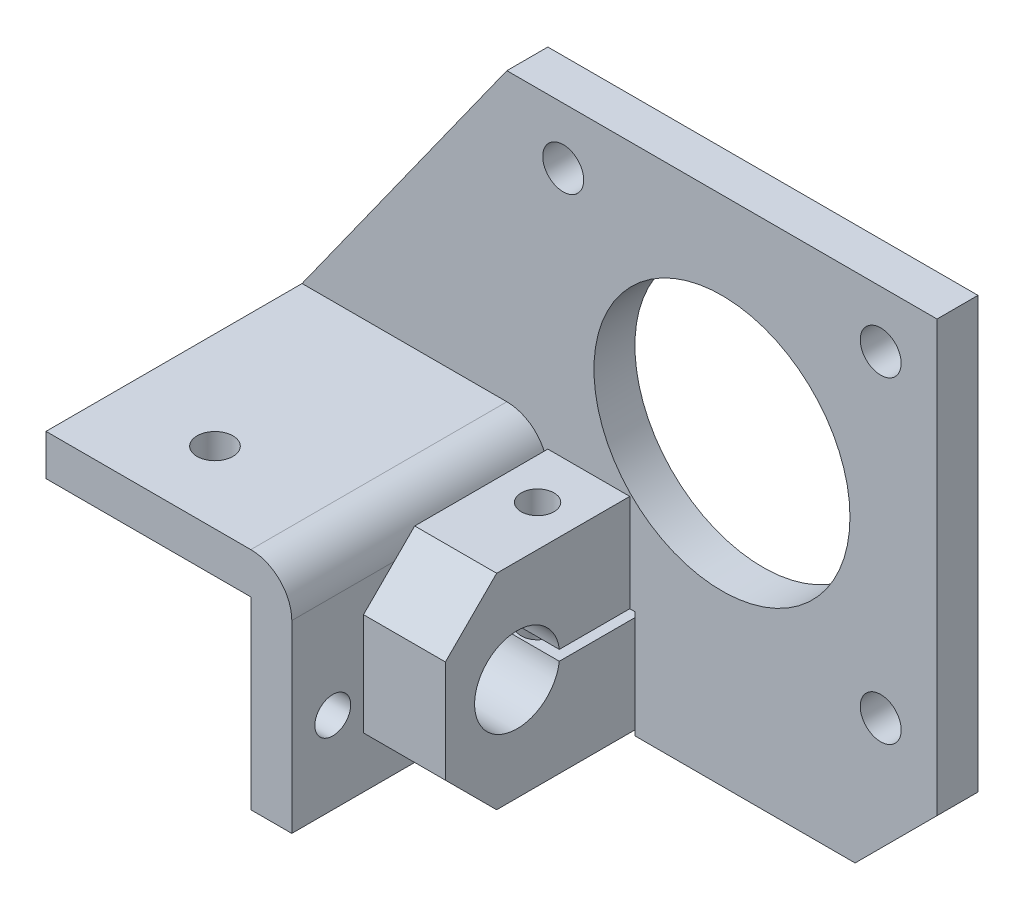
ISO-10303-21;
HEADER;
FILE_DESCRIPTION(('STEP AP214'),'2;1');
FILE_NAME('part.step','',(''),(''),'','','');
FILE_SCHEMA(('AUTOMOTIVE_DESIGN { 1 0 10303 214 1 1 1 1 }'));
ENDSEC;
DATA;
#1=APPLICATION_CONTEXT('core data for automotive mechanical design processes');
#2=APPLICATION_PROTOCOL_DEFINITION('international standard','automotive_design',2000,#1);
#3=PRODUCT_CONTEXT('',#1,'mechanical');
#4=PRODUCT('Part','Part','',(#3));
#5=PRODUCT_RELATED_PRODUCT_CATEGORY('part','',(#4));
#6=PRODUCT_DEFINITION_FORMATION('','',#4);
#7=PRODUCT_DEFINITION_CONTEXT('part definition',#1,'design');
#8=PRODUCT_DEFINITION('design','',#6,#7);
#9=PRODUCT_DEFINITION_SHAPE('','',#8);
#10=(LENGTH_UNIT() NAMED_UNIT(*) SI_UNIT(.MILLI.,.METRE.));
#11=(NAMED_UNIT(*) PLANE_ANGLE_UNIT() SI_UNIT($,.RADIAN.));
#12=(NAMED_UNIT(*) SI_UNIT($,.STERADIAN.) SOLID_ANGLE_UNIT());
#13=UNCERTAINTY_MEASURE_WITH_UNIT(LENGTH_MEASURE(1.E-05),#10,'distance_accuracy_value','');
#14=(GEOMETRIC_REPRESENTATION_CONTEXT(3) GLOBAL_UNCERTAINTY_ASSIGNED_CONTEXT((#13)) GLOBAL_UNIT_ASSIGNED_CONTEXT((#10,
#11,#12)) REPRESENTATION_CONTEXT('',''));
#15=CARTESIAN_POINT('',(0.,0.,0.));
#16=DIRECTION('',(0.,0.,1.));
#17=DIRECTION('',(1.,0.,0.));
#18=AXIS2_PLACEMENT_3D('',#15,#16,#17);
#19=CARTESIAN_POINT('',(0.,0.,0.));
#20=DIRECTION('',(0.,0.,1.));
#21=DIRECTION('',(-1.,0.,0.));
#22=AXIS2_PLACEMENT_3D('',#19,#20,#21);
#23=PLANE('',#22);
#24=CARTESIAN_POINT('',(15.5,-15.5,0.));
#25=DIRECTION('',(0.,0.,1.));
#26=DIRECTION('',(1.,0.,0.));
#27=AXIS2_PLACEMENT_3D('',#24,#25,#26);
#28=CIRCLE('',#27,2.);
#29=CARTESIAN_POINT('',(17.5,-15.5,0.));
#30=VERTEX_POINT('',#29);
#31=EDGE_CURVE('E320',#30,#30,#28,.T.);
#32=ORIENTED_EDGE('',*,*,#31,.F.);
#33=EDGE_LOOP('',(#32));
#34=FACE_BOUND('',#33,.T.);
#35=CARTESIAN_POINT('',(-15.5,15.5,0.));
#36=DIRECTION('',(0.,0.,1.));
#37=DIRECTION('',(1.,0.,0.));
#38=AXIS2_PLACEMENT_3D('',#35,#36,#37);
#39=CIRCLE('',#38,2.);
#40=CARTESIAN_POINT('',(-13.5,15.5,0.));
#41=VERTEX_POINT('',#40);
#42=EDGE_CURVE('E332',#41,#41,#39,.T.);
#43=ORIENTED_EDGE('',*,*,#42,.F.);
#44=EDGE_LOOP('',(#43));
#45=FACE_BOUND('',#44,.T.);
#46=CARTESIAN_POINT('',(15.5,15.5,0.));
#47=DIRECTION('',(0.,0.,1.));
#48=DIRECTION('',(1.,0.,0.));
#49=AXIS2_PLACEMENT_3D('',#46,#47,#48);
#50=CIRCLE('',#49,2.);
#51=CARTESIAN_POINT('',(17.5,15.5,0.));
#52=VERTEX_POINT('',#51);
#53=EDGE_CURVE('E326',#52,#52,#50,.T.);
#54=ORIENTED_EDGE('',*,*,#53,.F.);
#55=EDGE_LOOP('',(#54));
#56=FACE_BOUND('',#55,.T.);
#57=CARTESIAN_POINT('',(0.,0.,0.));
#58=DIRECTION('',(0.,0.,1.));
#59=DIRECTION('',(1.,0.,0.));
#60=AXIS2_PLACEMENT_3D('',#57,#58,#59);
#61=CIRCLE('',#60,12.5);
#62=CARTESIAN_POINT('',(12.5,0.,0.));
#63=VERTEX_POINT('',#62);
#64=EDGE_CURVE('E316',#63,#63,#61,.T.);
#65=ORIENTED_EDGE('',*,*,#64,.F.);
#66=EDGE_LOOP('',(#65));
#67=FACE_BOUND('',#66,.T.);
#68=DIRECTION('',(1.,0.,0.));
#69=VECTOR('',#68,1.);
#70=CARTESIAN_POINT('',(-21.,-29.,0.));
#71=LINE('',#70,#69);
#72=CARTESIAN_POINT('',(-8.49999999999999,-29.,0.));
#73=VERTEX_POINT('',#72);
#74=CARTESIAN_POINT('',(13.,-29.,0.));
#75=VERTEX_POINT('',#74);
#76=EDGE_CURVE('E345',#73,#75,#71,.T.);
#77=ORIENTED_EDGE('',*,*,#76,.T.);
#78=DIRECTION('',(0.707106781186546,0.707106781186549,0.));
#79=VECTOR('',#78,1.);
#80=CARTESIAN_POINT('',(13.,-29.,0.));
#81=LINE('',#80,#79);
#82=CARTESIAN_POINT('',(21.,-21.,0.));
#83=VERTEX_POINT('',#82);
#84=EDGE_CURVE('E338',#75,#83,#81,.T.);
#85=ORIENTED_EDGE('',*,*,#84,.T.);
#86=DIRECTION('',(0.,1.,0.));
#87=VECTOR('',#86,1.);
#88=CARTESIAN_POINT('',(21.,21.,0.));
#89=LINE('',#88,#87);
#90=CARTESIAN_POINT('',(21.,21.,0.));
#91=VERTEX_POINT('',#90);
#92=EDGE_CURVE('E369',#83,#91,#89,.T.);
#93=ORIENTED_EDGE('',*,*,#92,.T.);
#94=DIRECTION('',(-1.,0.,0.));
#95=VECTOR('',#94,1.);
#96=CARTESIAN_POINT('',(-21.,21.,0.));
#97=LINE('',#96,#95);
#98=CARTESIAN_POINT('',(-21.,21.,0.));
#99=VERTEX_POINT('',#98);
#100=EDGE_CURVE('E372',#91,#99,#97,.T.);
#101=ORIENTED_EDGE('',*,*,#100,.T.);
#102=DIRECTION('',(-0.581238193719096,-0.813733471206735,0.));
#103=VECTOR('',#102,1.);
#104=CARTESIAN_POINT('',(-41.,-7.00000000000001,0.));
#105=LINE('',#104,#103);
#106=CARTESIAN_POINT('',(-41.,-7.00000000000001,0.));
#107=VERTEX_POINT('',#106);
#108=EDGE_CURVE('E375',#99,#107,#105,.T.);
#109=ORIENTED_EDGE('',*,*,#108,.T.);
#110=DIRECTION('',(1.,0.,0.));
#111=VECTOR('',#110,1.);
#112=CARTESIAN_POINT('',(-41.,-7.00000000000001,0.));
#113=LINE('',#112,#111);
#114=CARTESIAN_POINT('',(-21.,-7.00000000000001,0.));
#115=VERTEX_POINT('',#114);
#116=EDGE_CURVE('E281',#107,#115,#113,.T.);
#117=ORIENTED_EDGE('',*,*,#116,.T.);
#118=CARTESIAN_POINT('',(-21.,-11.,0.));
#119=DIRECTION('',(0.,0.,-1.));
#120=DIRECTION('',(-1.,0.,0.));
#121=AXIS2_PLACEMENT_3D('',#118,#119,#120);
#122=CIRCLE('',#121,4.);
#123=CARTESIAN_POINT('',(-17.,-11.,0.));
#124=VERTEX_POINT('',#123);
#125=EDGE_CURVE('E285',#115,#124,#122,.T.);
#126=ORIENTED_EDGE('',*,*,#125,.T.);
#127=DIRECTION('',(0.,-1.,0.));
#128=VECTOR('',#127,1.);
#129=CARTESIAN_POINT('',(-17.,-29.,0.));
#130=LINE('',#129,#128);
#131=CARTESIAN_POINT('',(-17.,-9.00000000000001,0.));
#132=VERTEX_POINT('',#131);
#133=EDGE_CURVE('E241',#132,#124,#130,.T.);
#134=ORIENTED_EDGE('',*,*,#133,.F.);
#135=DIRECTION('',(-1.,0.,0.));
#136=VECTOR('',#135,1.);
#137=CARTESIAN_POINT('',(-8.99999999999998,-9.00000000000001,0.));
#138=LINE('',#137,#136);
#139=CARTESIAN_POINT('',(-8.99999999999998,-9.00000000000001,0.));
#140=VERTEX_POINT('',#139);
#141=EDGE_CURVE('E258',#140,#132,#138,.T.);
#142=ORIENTED_EDGE('',*,*,#141,.F.);
#143=DIRECTION('',(0.,-1.,0.));
#144=VECTOR('',#143,1.);
#145=CARTESIAN_POINT('',(-8.99999999999999,-29.,0.));
#146=LINE('',#145,#144);
#147=CARTESIAN_POINT('',(-8.99999999999999,-18.5,0.));
#148=VERTEX_POINT('',#147);
#149=EDGE_CURVE('E242',#140,#148,#146,.T.);
#150=ORIENTED_EDGE('',*,*,#149,.T.);
#151=DIRECTION('',(-1.,0.,0.));
#152=VECTOR('',#151,1.);
#153=CARTESIAN_POINT('',(0.,-18.5,0.));
#154=LINE('',#153,#152);
#155=CARTESIAN_POINT('',(-8.49999999999999,-18.5,0.));
#156=VERTEX_POINT('',#155);
#157=EDGE_CURVE('E220',#156,#148,#154,.T.);
#158=ORIENTED_EDGE('',*,*,#157,.F.);
#159=DIRECTION('',(0.,1.,0.));
#160=VECTOR('',#159,1.);
#161=CARTESIAN_POINT('',(-8.49999999999998,0.,0.));
#162=LINE('',#161,#160);
#163=EDGE_CURVE('E236',#73,#156,#162,.T.);
#164=ORIENTED_EDGE('',*,*,#163,.F.);
#165=EDGE_LOOP('',(#77,#85,#93,#101,#109,#117,#126,#134,#142,#150,#158,#164));
#166=FACE_BOUND('',#165,.T.);
#167=ADVANCED_FACE('F35',(#34,#45,#56,#67,#166),#23,.T.);
#168=CARTESIAN_POINT('',(0.,0.,-4.));
#169=DIRECTION('',(0.,0.,1.));
#170=DIRECTION('',(-1.,0.,0.));
#171=AXIS2_PLACEMENT_3D('',#168,#169,#170);
#172=PLANE('',#171);
#173=DIRECTION('',(0.,-1.,0.));
#174=VECTOR('',#173,1.);
#175=CARTESIAN_POINT('',(-8.99999999999998,0.,-4.));
#176=LINE('',#175,#174);
#177=CARTESIAN_POINT('',(-8.99999999999999,-19.5,-4.));
#178=VERTEX_POINT('',#177);
#179=CARTESIAN_POINT('',(-8.99999999999999,-29.,-4.));
#180=VERTEX_POINT('',#179);
#181=EDGE_CURVE('E230',#178,#180,#176,.T.);
#182=ORIENTED_EDGE('',*,*,#181,.T.);
#183=DIRECTION('',(1.,0.,0.));
#184=VECTOR('',#183,1.);
#185=CARTESIAN_POINT('',(-21.,-29.,-4.));
#186=LINE('',#185,#184);
#187=CARTESIAN_POINT('',(-21.,-29.,-4.));
#188=VERTEX_POINT('',#187);
#189=EDGE_CURVE('E363',#188,#180,#186,.T.);
#190=ORIENTED_EDGE('',*,*,#189,.F.);
#191=DIRECTION('',(0.,-1.,0.));
#192=VECTOR('',#191,1.);
#193=CARTESIAN_POINT('',(-21.,-11.,-4.));
#194=LINE('',#193,#192);
#195=CARTESIAN_POINT('',(-21.,-19.5,-4.));
#196=VERTEX_POINT('',#195);
#197=EDGE_CURVE('E360',#196,#188,#194,.T.);
#198=ORIENTED_EDGE('',*,*,#197,.F.);
#199=DIRECTION('',(1.,0.,0.));
#200=VECTOR('',#199,1.);
#201=CARTESIAN_POINT('',(0.,-19.5,-4.));
#202=LINE('',#201,#200);
#203=EDGE_CURVE('E227',#196,#178,#202,.T.);
#204=ORIENTED_EDGE('',*,*,#203,.T.);
#205=EDGE_LOOP('',(#182,#190,#198,#204));
#206=FACE_BOUND('',#205,.T.);
#207=ADVANCED_FACE('F459',(#206),#172,.F.);
#208=CARTESIAN_POINT('',(0.,0.,-4.));
#209=DIRECTION('',(0.,0.,1.));
#210=DIRECTION('',(1.,0.,0.));
#211=AXIS2_PLACEMENT_3D('',#208,#209,#210);
#212=CIRCLE('',#211,12.5);
#213=CARTESIAN_POINT('',(12.5,0.,-4.));
#214=VERTEX_POINT('',#213);
#215=EDGE_CURVE('E317',#214,#214,#212,.T.);
#216=ORIENTED_EDGE('',*,*,#215,.T.);
#217=EDGE_LOOP('',(#216));
#218=FACE_BOUND('',#217,.T.);
#219=CARTESIAN_POINT('',(15.5,-15.5,-4.));
#220=DIRECTION('',(0.,0.,1.));
#221=DIRECTION('',(1.,0.,0.));
#222=AXIS2_PLACEMENT_3D('',#219,#220,#221);
#223=CIRCLE('',#222,2.);
#224=CARTESIAN_POINT('',(17.5,-15.5,-4.));
#225=VERTEX_POINT('',#224);
#226=EDGE_CURVE('E323',#225,#225,#223,.T.);
#227=ORIENTED_EDGE('',*,*,#226,.T.);
#228=EDGE_LOOP('',(#227));
#229=FACE_BOUND('',#228,.T.);
#230=CARTESIAN_POINT('',(15.5,15.5,-4.));
#231=DIRECTION('',(0.,0.,1.));
#232=DIRECTION('',(1.,0.,0.));
#233=AXIS2_PLACEMENT_3D('',#230,#231,#232);
#234=CIRCLE('',#233,2.);
#235=CARTESIAN_POINT('',(17.5,15.5,-4.));
#236=VERTEX_POINT('',#235);
#237=EDGE_CURVE('E329',#236,#236,#234,.T.);
#238=ORIENTED_EDGE('',*,*,#237,.T.);
#239=EDGE_LOOP('',(#238));
#240=FACE_BOUND('',#239,.T.);
#241=CARTESIAN_POINT('',(-15.5,15.5,-4.));
#242=DIRECTION('',(0.,0.,1.));
#243=DIRECTION('',(1.,0.,0.));
#244=AXIS2_PLACEMENT_3D('',#241,#242,#243);
#245=CIRCLE('',#244,2.);
#246=CARTESIAN_POINT('',(-13.5,15.5,-4.));
#247=VERTEX_POINT('',#246);
#248=EDGE_CURVE('E335',#247,#247,#245,.T.);
#249=ORIENTED_EDGE('',*,*,#248,.T.);
#250=EDGE_LOOP('',(#249));
#251=FACE_BOUND('',#250,.T.);
#252=DIRECTION('',(0.,1.,0.));
#253=VECTOR('',#252,1.);
#254=CARTESIAN_POINT('',(-8.49999999999998,0.,-4.));
#255=LINE('',#254,#253);
#256=CARTESIAN_POINT('',(-8.49999999999999,-29.,-4.));
#257=VERTEX_POINT('',#256);
#258=CARTESIAN_POINT('',(-8.49999999999999,-18.5,-4.));
#259=VERTEX_POINT('',#258);
#260=EDGE_CURVE('E233',#257,#259,#255,.T.);
#261=ORIENTED_EDGE('',*,*,#260,.T.);
#262=DIRECTION('',(-1.,0.,0.));
#263=VECTOR('',#262,1.);
#264=CARTESIAN_POINT('',(0.,-18.5,-4.));
#265=LINE('',#264,#263);
#266=CARTESIAN_POINT('',(-21.,-18.5,-4.));
#267=VERTEX_POINT('',#266);
#268=EDGE_CURVE('E219',#259,#267,#265,.T.);
#269=ORIENTED_EDGE('',*,*,#268,.T.);
#270=CARTESIAN_POINT('',(-21.,-11.,-4.));
#271=VERTEX_POINT('',#270);
#272=EDGE_CURVE('E217',#271,#267,#194,.T.);
#273=ORIENTED_EDGE('',*,*,#272,.F.);
#274=DIRECTION('',(1.,0.,0.));
#275=VECTOR('',#274,1.);
#276=CARTESIAN_POINT('',(-21.,-11.,-4.));
#277=LINE('',#276,#275);
#278=CARTESIAN_POINT('',(-41.,-11.,-4.));
#279=VERTEX_POINT('',#278);
#280=EDGE_CURVE('E357',#279,#271,#277,.T.);
#281=ORIENTED_EDGE('',*,*,#280,.F.);
#282=DIRECTION('',(0.,-1.,0.));
#283=VECTOR('',#282,1.);
#284=CARTESIAN_POINT('',(-41.,-11.,-4.));
#285=LINE('',#284,#283);
#286=CARTESIAN_POINT('',(-41.,-7.00000000000001,-4.));
#287=VERTEX_POINT('',#286);
#288=EDGE_CURVE('E354',#287,#279,#285,.T.);
#289=ORIENTED_EDGE('',*,*,#288,.F.);
#290=DIRECTION('',(-0.581238193719096,-0.813733471206735,0.));
#291=VECTOR('',#290,1.);
#292=CARTESIAN_POINT('',(-41.,-7.00000000000001,-4.));
#293=LINE('',#292,#291);
#294=CARTESIAN_POINT('',(-21.,21.,-4.));
#295=VERTEX_POINT('',#294);
#296=EDGE_CURVE('E351',#295,#287,#293,.T.);
#297=ORIENTED_EDGE('',*,*,#296,.F.);
#298=DIRECTION('',(-1.,0.,0.));
#299=VECTOR('',#298,1.);
#300=CARTESIAN_POINT('',(-21.,21.,-4.));
#301=LINE('',#300,#299);
#302=CARTESIAN_POINT('',(21.,21.,-4.));
#303=VERTEX_POINT('',#302);
#304=EDGE_CURVE('E348',#303,#295,#301,.T.);
#305=ORIENTED_EDGE('',*,*,#304,.F.);
#306=DIRECTION('',(0.,1.,0.));
#307=VECTOR('',#306,1.);
#308=CARTESIAN_POINT('',(21.,21.,-4.));
#309=LINE('',#308,#307);
#310=CARTESIAN_POINT('',(21.,-21.,-4.));
#311=VERTEX_POINT('',#310);
#312=EDGE_CURVE('E344',#311,#303,#309,.T.);
#313=ORIENTED_EDGE('',*,*,#312,.F.);
#314=DIRECTION('',(0.707106781186546,0.707106781186549,0.));
#315=VECTOR('',#314,1.);
#316=CARTESIAN_POINT('',(13.,-29.,-4.));
#317=LINE('',#316,#315);
#318=CARTESIAN_POINT('',(13.,-29.,-4.));
#319=VERTEX_POINT('',#318);
#320=EDGE_CURVE('E341',#319,#311,#317,.T.);
#321=ORIENTED_EDGE('',*,*,#320,.F.);
#322=EDGE_CURVE('E362',#257,#319,#186,.T.);
#323=ORIENTED_EDGE('',*,*,#322,.F.);
#324=EDGE_LOOP('',(#261,#269,#273,#281,#289,#297,#305,#313,#321,#323));
#325=FACE_BOUND('',#324,.T.);
#326=ADVANCED_FACE('F473',(#218,#229,#240,#251,#325),#172,.F.);
#327=CARTESIAN_POINT('',(-21.,-21.,-4.));
#328=DIRECTION('',(1.,0.,0.));
#329=DIRECTION('',(0.,1.,0.));
#330=AXIS2_PLACEMENT_3D('',#327,#328,#329);
#331=PLANE('',#330);
#332=CARTESIAN_POINT('',(-21.,-21.,21.));
#333=DIRECTION('',(-1.,0.,0.));
#334=DIRECTION('',(0.,1.,0.));
#335=AXIS2_PLACEMENT_3D('',#332,#333,#334);
#336=CIRCLE('',#335,1.75);
#337=CARTESIAN_POINT('',(-21.,-19.25,21.));
#338=VERTEX_POINT('',#337);
#339=EDGE_CURVE('E417',#338,#338,#336,.T.);
#340=ORIENTED_EDGE('',*,*,#339,.F.);
#341=EDGE_LOOP('',(#340));
#342=FACE_BOUND('',#341,.T.);
#343=DIRECTION('',(0.,0.,-1.));
#344=VECTOR('',#343,1.);
#345=CARTESIAN_POINT('',(-21.,-19.5,8.));
#346=LINE('',#345,#344);
#347=CARTESIAN_POINT('',(-21.,-19.5,6.8802305889771));
#348=VERTEX_POINT('',#347);
#349=EDGE_CURVE('E422',#348,#196,#346,.T.);
#350=ORIENTED_EDGE('',*,*,#349,.T.);
#351=ORIENTED_EDGE('',*,*,#197,.T.);
#352=DIRECTION('',(0.,0.,1.));
#353=VECTOR('',#352,1.);
#354=CARTESIAN_POINT('',(-21.,-29.,-4.));
#355=LINE('',#354,#353);
#356=CARTESIAN_POINT('',(-21.,-29.,25.));
#357=VERTEX_POINT('',#356);
#358=EDGE_CURVE('E381',#188,#357,#355,.T.);
#359=ORIENTED_EDGE('',*,*,#358,.T.);
#360=DIRECTION('',(0.,1.,0.));
#361=VECTOR('',#360,1.);
#362=CARTESIAN_POINT('',(-21.,-29.,25.));
#363=LINE('',#362,#361);
#364=CARTESIAN_POINT('',(-21.,-11.,25.));
#365=VERTEX_POINT('',#364);
#366=EDGE_CURVE('E298',#357,#365,#363,.T.);
#367=ORIENTED_EDGE('',*,*,#366,.T.);
#368=DIRECTION('',(0.,0.,1.));
#369=VECTOR('',#368,1.);
#370=CARTESIAN_POINT('',(-21.,-11.,-4.));
#371=LINE('',#370,#369);
#372=EDGE_CURVE('E384',#271,#365,#371,.T.);
#373=ORIENTED_EDGE('',*,*,#372,.F.);
#374=ORIENTED_EDGE('',*,*,#272,.T.);
#375=DIRECTION('',(0.,0.,1.));
#376=VECTOR('',#375,1.);
#377=CARTESIAN_POINT('',(-21.,-18.5,-4.));
#378=LINE('',#377,#376);
#379=CARTESIAN_POINT('',(-21.,-18.5,6.8802305889771));
#380=VERTEX_POINT('',#379);
#381=EDGE_CURVE('E197',#267,#380,#378,.T.);
#382=ORIENTED_EDGE('',*,*,#381,.T.);
#383=CARTESIAN_POINT('',(-21.,-19.,11.));
#384=DIRECTION('',(-1.,0.,0.));
#385=DIRECTION('',(0.,1.,0.));
#386=AXIS2_PLACEMENT_3D('',#383,#384,#385);
#387=CIRCLE('',#386,4.15);
#388=EDGE_CURVE('E207',#348,#380,#387,.T.);
#389=ORIENTED_EDGE('',*,*,#388,.F.);
#390=EDGE_LOOP('',(#350,#351,#359,#367,#373,#374,#382,#389));
#391=FACE_BOUND('',#390,.T.);
#392=ADVANCED_FACE('F215',(#342,#391),#331,.F.);
#393=CARTESIAN_POINT('',(-21.,-29.,-4.));
#394=DIRECTION('',(0.,1.,0.));
#395=DIRECTION('',(-1.,0.,0.));
#396=AXIS2_PLACEMENT_3D('',#393,#394,#395);
#397=PLANE('',#396);
#398=DIRECTION('',(0.,0.,-1.));
#399=VECTOR('',#398,1.);
#400=CARTESIAN_POINT('',(-8.49999999999999,-29.,8.));
#401=LINE('',#400,#399);
#402=EDGE_CURVE('E204',#73,#257,#401,.T.);
#403=ORIENTED_EDGE('',*,*,#402,.T.);
#404=ORIENTED_EDGE('',*,*,#322,.T.);
#405=DIRECTION('',(0.,0.,1.));
#406=VECTOR('',#405,1.);
#407=CARTESIAN_POINT('',(13.,-29.,-4.));
#408=LINE('',#407,#406);
#409=EDGE_CURVE('E366',#319,#75,#408,.T.);
#410=ORIENTED_EDGE('',*,*,#409,.T.);
#411=ORIENTED_EDGE('',*,*,#76,.F.);
#412=EDGE_LOOP('',(#403,#404,#410,#411));
#413=FACE_BOUND('',#412,.T.);
#414=ADVANCED_FACE('F482',(#413),#397,.F.);
#415=CARTESIAN_POINT('',(-13.,-29.,5.));
#416=DIRECTION('',(0.,1.,0.));
#417=DIRECTION('',(0.,0.,1.));
#418=AXIS2_PLACEMENT_3D('',#415,#416,#417);
#419=CIRCLE('',#418,1.6);
#420=CARTESIAN_POINT('',(-13.,-29.,6.6));
#421=VERTEX_POINT('',#420);
#422=EDGE_CURVE('E860',#421,#421,#419,.T.);
#423=ORIENTED_EDGE('',*,*,#422,.T.);
#424=EDGE_LOOP('',(#423));
#425=FACE_BOUND('',#424,.T.);
#426=DIRECTION('',(0.,0.,1.));
#427=VECTOR('',#426,1.);
#428=CARTESIAN_POINT('',(-8.99999999999999,-29.,13.));
#429=LINE('',#428,#427);
#430=CARTESIAN_POINT('',(-8.99999999999999,-29.,13.));
#431=VERTEX_POINT('',#430);
#432=EDGE_CURVE('E245',#180,#431,#429,.T.);
#433=ORIENTED_EDGE('',*,*,#432,.T.);
#434=DIRECTION('',(-1.,0.,0.));
#435=VECTOR('',#434,1.);
#436=CARTESIAN_POINT('',(-8.99999999999999,-29.,13.));
#437=LINE('',#436,#435);
#438=CARTESIAN_POINT('',(-17.,-29.,13.));
#439=VERTEX_POINT('',#438);
#440=EDGE_CURVE('E278',#431,#439,#437,.T.);
#441=ORIENTED_EDGE('',*,*,#440,.T.);
#442=DIRECTION('',(0.,0.,-1.));
#443=VECTOR('',#442,1.);
#444=CARTESIAN_POINT('',(-17.,-29.,25.));
#445=LINE('',#444,#443);
#446=CARTESIAN_POINT('',(-17.,-29.,25.));
#447=VERTEX_POINT('',#446);
#448=EDGE_CURVE('E301',#447,#439,#445,.T.);
#449=ORIENTED_EDGE('',*,*,#448,.F.);
#450=DIRECTION('',(-1.,0.,0.));
#451=VECTOR('',#450,1.);
#452=CARTESIAN_POINT('',(-17.,-29.,25.));
#453=LINE('',#452,#451);
#454=EDGE_CURVE('E296',#447,#357,#453,.T.);
#455=ORIENTED_EDGE('',*,*,#454,.T.);
#456=ORIENTED_EDGE('',*,*,#358,.F.);
#457=ORIENTED_EDGE('',*,*,#189,.T.);
#458=EDGE_LOOP('',(#433,#441,#449,#455,#456,#457));
#459=FACE_BOUND('',#458,.T.);
#460=ADVANCED_FACE('F454',(#425,#459),#397,.F.);
#461=CARTESIAN_POINT('',(-8.99999999999998,0.,0.));
#462=DIRECTION('',(-1.,0.,0.));
#463=DIRECTION('',(0.,-1.,0.));
#464=AXIS2_PLACEMENT_3D('',#461,#462,#463);
#465=PLANE('',#464);
#466=DIRECTION('',(0.,0.,-1.));
#467=VECTOR('',#466,1.);
#468=CARTESIAN_POINT('',(-8.99999999999999,-18.5,0.));
#469=LINE('',#468,#467);
#470=CARTESIAN_POINT('',(-8.99999999999999,-18.5,6.88023058897709));
#471=VERTEX_POINT('',#470);
#472=EDGE_CURVE('E200',#471,#148,#469,.T.);
#473=ORIENTED_EDGE('',*,*,#472,.T.);
#474=ORIENTED_EDGE('',*,*,#149,.F.);
#475=DIRECTION('',(0.,0.,-1.));
#476=VECTOR('',#475,1.);
#477=CARTESIAN_POINT('',(-8.99999999999998,-9.00000000000001,0.));
#478=LINE('',#477,#476);
#479=CARTESIAN_POINT('',(-8.99999999999998,-9.00000000000001,13.));
#480=VERTEX_POINT('',#479);
#481=EDGE_CURVE('E59',#480,#140,#478,.T.);
#482=ORIENTED_EDGE('',*,*,#481,.F.);
#483=DIRECTION('',(0.,0.707106781186547,-0.707106781186548));
#484=VECTOR('',#483,1.);
#485=CARTESIAN_POINT('',(-8.99999999999998,-9.00000000000001,13.));
#486=LINE('',#485,#484);
#487=CARTESIAN_POINT('',(-8.99999999999999,-14.,18.));
#488=VERTEX_POINT('',#487);
#489=EDGE_CURVE('E254',#488,#480,#486,.T.);
#490=ORIENTED_EDGE('',*,*,#489,.F.);
#491=DIRECTION('',(0.,1.,0.));
#492=VECTOR('',#491,1.);
#493=CARTESIAN_POINT('',(-8.99999999999999,-14.,18.));
#494=LINE('',#493,#492);
#495=CARTESIAN_POINT('',(-8.99999999999999,-24.,18.));
#496=VERTEX_POINT('',#495);
#497=EDGE_CURVE('E251',#496,#488,#494,.T.);
#498=ORIENTED_EDGE('',*,*,#497,.F.);
#499=DIRECTION('',(0.,0.707106781186548,0.707106781186548));
#500=VECTOR('',#499,1.);
#501=CARTESIAN_POINT('',(-8.99999999999999,-24.,18.));
#502=LINE('',#501,#500);
#503=EDGE_CURVE('E248',#431,#496,#502,.T.);
#504=ORIENTED_EDGE('',*,*,#503,.F.);
#505=ORIENTED_EDGE('',*,*,#432,.F.);
#506=ORIENTED_EDGE('',*,*,#181,.F.);
#507=DIRECTION('',(0.,0.,-1.));
#508=VECTOR('',#507,1.);
#509=CARTESIAN_POINT('',(-8.99999999999999,-19.5,8.));
#510=LINE('',#509,#508);
#511=CARTESIAN_POINT('',(-8.99999999999999,-19.5,6.8802305889771));
#512=VERTEX_POINT('',#511);
#513=EDGE_CURVE('E424',#512,#178,#510,.T.);
#514=ORIENTED_EDGE('',*,*,#513,.F.);
#515=CARTESIAN_POINT('',(-8.99999999999999,-19.,11.));
#516=DIRECTION('',(-1.,0.,0.));
#517=DIRECTION('',(0.,1.,0.));
#518=AXIS2_PLACEMENT_3D('',#515,#516,#517);
#519=CIRCLE('',#518,4.15);
#520=EDGE_CURVE('E239',#512,#471,#519,.T.);
#521=ORIENTED_EDGE('',*,*,#520,.T.);
#522=EDGE_LOOP('',(#473,#474,#482,#490,#498,#504,#505,#506,#514,#521));
#523=FACE_BOUND('',#522,.T.);
#524=ADVANCED_FACE('F427',(#523),#465,.F.);
#525=CARTESIAN_POINT('',(-8.99999999999999,-19.,11.));
#526=DIRECTION('',(-1.,0.,0.));
#527=DIRECTION('',(0.,-1.,0.));
#528=AXIS2_PLACEMENT_3D('',#525,#526,#527);
#529=CYLINDRICAL_SURFACE('',#528,4.15);
#530=DIRECTION('',(-1.,0.,0.));
#531=VECTOR('',#530,1.);
#532=CARTESIAN_POINT('',(-8.99999999999999,-18.5,6.88023058897709));
#533=LINE('',#532,#531);
#534=EDGE_CURVE('E192',#471,#380,#533,.T.);
#535=ORIENTED_EDGE('',*,*,#534,.F.);
#536=ORIENTED_EDGE('',*,*,#520,.F.);
#537=DIRECTION('',(-1.,0.,0.));
#538=VECTOR('',#537,1.);
#539=CARTESIAN_POINT('',(-8.99999999999999,-19.5,6.8802305889771));
#540=LINE('',#539,#538);
#541=EDGE_CURVE('E209',#348,#512,#540,.F.);
#542=ORIENTED_EDGE('',*,*,#541,.F.);
#543=ORIENTED_EDGE('',*,*,#388,.T.);
#544=EDGE_LOOP('',(#535,#536,#542,#543));
#545=FACE_BOUND('',#544,.T.);
#546=ADVANCED_FACE('F208',(#545),#529,.F.);
#547=CARTESIAN_POINT('',(13.,-29.,-4.));
#548=DIRECTION('',(-0.707106781186549,0.707106781186546,0.));
#549=DIRECTION('',(-0.707106781186546,-0.707106781186549,0.));
#550=AXIS2_PLACEMENT_3D('',#547,#548,#549);
#551=PLANE('',#550);
#552=ORIENTED_EDGE('',*,*,#84,.F.);
#553=ORIENTED_EDGE('',*,*,#409,.F.);
#554=ORIENTED_EDGE('',*,*,#320,.T.);
#555=DIRECTION('',(0.,0.,1.));
#556=VECTOR('',#555,1.);
#557=CARTESIAN_POINT('',(21.,-21.,-4.));
#558=LINE('',#557,#556);
#559=EDGE_CURVE('E11',#311,#83,#558,.T.);
#560=ORIENTED_EDGE('',*,*,#559,.T.);
#561=EDGE_LOOP('',(#552,#553,#554,#560));
#562=FACE_BOUND('',#561,.T.);
#563=ADVANCED_FACE('F37',(#562),#551,.F.);
#564=CARTESIAN_POINT('',(21.,21.,-4.));
#565=DIRECTION('',(-1.,0.,0.));
#566=DIRECTION('',(0.,-1.,0.));
#567=AXIS2_PLACEMENT_3D('',#564,#565,#566);
#568=PLANE('',#567);
#569=ORIENTED_EDGE('',*,*,#92,.F.);
#570=ORIENTED_EDGE('',*,*,#559,.F.);
#571=ORIENTED_EDGE('',*,*,#312,.T.);
#572=DIRECTION('',(0.,0.,1.));
#573=VECTOR('',#572,1.);
#574=CARTESIAN_POINT('',(21.,21.,-4.));
#575=LINE('',#574,#573);
#576=EDGE_CURVE('E44',#303,#91,#575,.T.);
#577=ORIENTED_EDGE('',*,*,#576,.T.);
#578=EDGE_LOOP('',(#569,#570,#571,#577));
#579=FACE_BOUND('',#578,.T.);
#580=ADVANCED_FACE('F488',(#579),#568,.F.);
#581=CARTESIAN_POINT('',(-21.,21.,-4.));
#582=DIRECTION('',(0.,-1.,0.));
#583=DIRECTION('',(0.,0.,1.));
#584=AXIS2_PLACEMENT_3D('',#581,#582,#583);
#585=PLANE('',#584);
#586=ORIENTED_EDGE('',*,*,#100,.F.);
#587=ORIENTED_EDGE('',*,*,#576,.F.);
#588=ORIENTED_EDGE('',*,*,#304,.T.);
#589=DIRECTION('',(0.,0.,1.));
#590=VECTOR('',#589,1.);
#591=CARTESIAN_POINT('',(-21.,21.,-4.));
#592=LINE('',#591,#590);
#593=EDGE_CURVE('E393',#295,#99,#592,.T.);
#594=ORIENTED_EDGE('',*,*,#593,.T.);
#595=EDGE_LOOP('',(#586,#587,#588,#594));
#596=FACE_BOUND('',#595,.T.);
#597=ADVANCED_FACE('F492',(#596),#585,.F.);
#598=CARTESIAN_POINT('',(-41.,-7.00000000000001,-4.));
#599=DIRECTION('',(0.813733471206735,-0.581238193719096,0.));
#600=DIRECTION('',(0.581238193719096,0.813733471206735,0.));
#601=AXIS2_PLACEMENT_3D('',#598,#599,#600);
#602=PLANE('',#601);
#603=ORIENTED_EDGE('',*,*,#108,.F.);
#604=ORIENTED_EDGE('',*,*,#593,.F.);
#605=ORIENTED_EDGE('',*,*,#296,.T.);
#606=DIRECTION('',(0.,0.,1.));
#607=VECTOR('',#606,1.);
#608=CARTESIAN_POINT('',(-41.,-7.00000000000001,-4.));
#609=LINE('',#608,#607);
#610=EDGE_CURVE('E390',#287,#107,#609,.T.);
#611=ORIENTED_EDGE('',*,*,#610,.T.);
#612=EDGE_LOOP('',(#603,#604,#605,#611));
#613=FACE_BOUND('',#612,.T.);
#614=ADVANCED_FACE('F496',(#613),#602,.F.);
#615=CARTESIAN_POINT('',(-41.,-11.,-4.));
#616=DIRECTION('',(1.,0.,0.));
#617=DIRECTION('',(0.,1.,0.));
#618=AXIS2_PLACEMENT_3D('',#615,#616,#617);
#619=PLANE('',#618);
#620=ORIENTED_EDGE('',*,*,#610,.F.);
#621=ORIENTED_EDGE('',*,*,#288,.T.);
#622=DIRECTION('',(0.,0.,1.));
#623=VECTOR('',#622,1.);
#624=CARTESIAN_POINT('',(-41.,-11.,-4.));
#625=LINE('',#624,#623);
#626=CARTESIAN_POINT('',(-41.,-11.,25.));
#627=VERTEX_POINT('',#626);
#628=EDGE_CURVE('E387',#279,#627,#625,.T.);
#629=ORIENTED_EDGE('',*,*,#628,.T.);
#630=DIRECTION('',(0.,1.,0.));
#631=VECTOR('',#630,1.);
#632=CARTESIAN_POINT('',(-41.,-11.,25.));
#633=LINE('',#632,#631);
#634=CARTESIAN_POINT('',(-41.,-7.00000000000001,25.));
#635=VERTEX_POINT('',#634);
#636=EDGE_CURVE('E284',#627,#635,#633,.T.);
#637=ORIENTED_EDGE('',*,*,#636,.T.);
#638=DIRECTION('',(0.,0.,-1.));
#639=VECTOR('',#638,1.);
#640=CARTESIAN_POINT('',(-41.,-7.00000000000001,25.));
#641=LINE('',#640,#639);
#642=EDGE_CURVE('E314',#635,#107,#641,.T.);
#643=ORIENTED_EDGE('',*,*,#642,.T.);
#644=EDGE_LOOP('',(#620,#621,#629,#637,#643));
#645=FACE_BOUND('',#644,.T.);
#646=ADVANCED_FACE('F535',(#645),#619,.F.);
#647=CARTESIAN_POINT('',(-21.,-11.,-4.));
#648=DIRECTION('',(0.,1.,0.));
#649=DIRECTION('',(-1.,0.,0.));
#650=AXIS2_PLACEMENT_3D('',#647,#648,#649);
#651=PLANE('',#650);
#652=CARTESIAN_POINT('',(-31.5,-11.,-2.));
#653=DIRECTION('',(0.,-1.,0.));
#654=DIRECTION('',(-1.,0.,0.));
#655=AXIS2_PLACEMENT_3D('',#652,#653,#654);
#656=CIRCLE('',#655,1.75);
#657=CARTESIAN_POINT('',(-33.25,-11.,-2.));
#658=VERTEX_POINT('',#657);
#659=EDGE_CURVE('E395',#658,#658,#656,.T.);
#660=ORIENTED_EDGE('',*,*,#659,.F.);
#661=EDGE_LOOP('',(#660));
#662=FACE_BOUND('',#661,.T.);
#663=CARTESIAN_POINT('',(-31.5,-11.,18.));
#664=DIRECTION('',(0.,-1.,0.));
#665=DIRECTION('',(-1.,0.,0.));
#666=AXIS2_PLACEMENT_3D('',#663,#664,#665);
#667=CIRCLE('',#666,1.75);
#668=CARTESIAN_POINT('',(-33.25,-11.,18.));
#669=VERTEX_POINT('',#668);
#670=EDGE_CURVE('E213',#669,#669,#667,.T.);
#671=ORIENTED_EDGE('',*,*,#670,.F.);
#672=EDGE_LOOP('',(#671));
#673=FACE_BOUND('',#672,.T.);
#674=ORIENTED_EDGE('',*,*,#628,.F.);
#675=ORIENTED_EDGE('',*,*,#280,.T.);
#676=ORIENTED_EDGE('',*,*,#372,.T.);
#677=DIRECTION('',(-1.,0.,0.));
#678=VECTOR('',#677,1.);
#679=CARTESIAN_POINT('',(-21.,-11.,25.));
#680=LINE('',#679,#678);
#681=EDGE_CURVE('E282',#365,#627,#680,.T.);
#682=ORIENTED_EDGE('',*,*,#681,.T.);
#683=EDGE_LOOP('',(#674,#675,#676,#682));
#684=FACE_BOUND('',#683,.T.);
#685=ADVANCED_FACE('F469',(#662,#673,#684),#651,.F.);
#686=CARTESIAN_POINT('',(-15.5,15.5,-4.));
#687=DIRECTION('',(0.,0.,1.));
#688=DIRECTION('',(-1.,0.,0.));
#689=AXIS2_PLACEMENT_3D('',#686,#687,#688);
#690=CYLINDRICAL_SURFACE('',#689,2.);
#691=ORIENTED_EDGE('',*,*,#248,.F.);
#692=EDGE_LOOP('',(#691));
#693=FACE_BOUND('',#692,.T.);
#694=ORIENTED_EDGE('',*,*,#42,.T.);
#695=EDGE_LOOP('',(#694));
#696=FACE_BOUND('',#695,.T.);
#697=ADVANCED_FACE('F534',(#693,#696),#690,.F.);
#698=CARTESIAN_POINT('',(15.5,15.5,-4.));
#699=DIRECTION('',(0.,0.,1.));
#700=DIRECTION('',(-1.,0.,0.));
#701=AXIS2_PLACEMENT_3D('',#698,#699,#700);
#702=CYLINDRICAL_SURFACE('',#701,2.);
#703=ORIENTED_EDGE('',*,*,#237,.F.);
#704=EDGE_LOOP('',(#703));
#705=FACE_BOUND('',#704,.T.);
#706=ORIENTED_EDGE('',*,*,#53,.T.);
#707=EDGE_LOOP('',(#706));
#708=FACE_BOUND('',#707,.T.);
#709=ADVANCED_FACE('F718',(#705,#708),#702,.F.);
#710=CARTESIAN_POINT('',(15.5,-15.5,-4.));
#711=DIRECTION('',(0.,0.,1.));
#712=DIRECTION('',(-1.,0.,0.));
#713=AXIS2_PLACEMENT_3D('',#710,#711,#712);
#714=CYLINDRICAL_SURFACE('',#713,2.);
#715=ORIENTED_EDGE('',*,*,#226,.F.);
#716=EDGE_LOOP('',(#715));
#717=FACE_BOUND('',#716,.T.);
#718=ORIENTED_EDGE('',*,*,#31,.T.);
#719=EDGE_LOOP('',(#718));
#720=FACE_BOUND('',#719,.T.);
#721=ADVANCED_FACE('F709',(#717,#720),#714,.F.);
#722=CARTESIAN_POINT('',(0.,0.,-4.));
#723=DIRECTION('',(0.,0.,1.));
#724=DIRECTION('',(-1.,0.,0.));
#725=AXIS2_PLACEMENT_3D('',#722,#723,#724);
#726=CYLINDRICAL_SURFACE('',#725,12.5);
#727=ORIENTED_EDGE('',*,*,#215,.F.);
#728=EDGE_LOOP('',(#727));
#729=FACE_BOUND('',#728,.T.);
#730=ORIENTED_EDGE('',*,*,#64,.T.);
#731=EDGE_LOOP('',(#730));
#732=FACE_BOUND('',#731,.T.);
#733=ADVANCED_FACE('F513',(#729,#732),#726,.F.);
#734=CARTESIAN_POINT('',(-41.,-7.00000000000001,25.));
#735=DIRECTION('',(0.,-1.,0.));
#736=DIRECTION('',(1.,0.,0.));
#737=AXIS2_PLACEMENT_3D('',#734,#735,#736);
#738=PLANE('',#737);
#739=CARTESIAN_POINT('',(-31.5,-7.00000000000001,18.));
#740=DIRECTION('',(0.,-1.,0.));
#741=DIRECTION('',(-1.,0.,0.));
#742=AXIS2_PLACEMENT_3D('',#739,#740,#741);
#743=CIRCLE('',#742,1.75);
#744=CARTESIAN_POINT('',(-33.25,-7.00000000000001,18.));
#745=VERTEX_POINT('',#744);
#746=EDGE_CURVE('E397',#745,#745,#743,.T.);
#747=ORIENTED_EDGE('',*,*,#746,.T.);
#748=EDGE_LOOP('',(#747));
#749=FACE_BOUND('',#748,.T.);
#750=ORIENTED_EDGE('',*,*,#116,.F.);
#751=ORIENTED_EDGE('',*,*,#642,.F.);
#752=DIRECTION('',(1.,0.,0.));
#753=VECTOR('',#752,1.);
#754=CARTESIAN_POINT('',(-41.,-7.00000000000001,25.));
#755=LINE('',#754,#753);
#756=CARTESIAN_POINT('',(-21.,-7.00000000000001,25.));
#757=VERTEX_POINT('',#756);
#758=EDGE_CURVE('E288',#635,#757,#755,.T.);
#759=ORIENTED_EDGE('',*,*,#758,.T.);
#760=DIRECTION('',(0.,0.,-1.));
#761=VECTOR('',#760,1.);
#762=CARTESIAN_POINT('',(-21.,-7.00000000000001,25.));
#763=LINE('',#762,#761);
#764=EDGE_CURVE('E312',#757,#115,#763,.T.);
#765=ORIENTED_EDGE('',*,*,#764,.T.);
#766=EDGE_LOOP('',(#750,#751,#759,#765));
#767=FACE_BOUND('',#766,.T.);
#768=ADVANCED_FACE('F501',(#749,#767),#738,.F.);
#769=CARTESIAN_POINT('',(-21.,-11.,25.));
#770=DIRECTION('',(0.,0.,-1.));
#771=DIRECTION('',(1.,0.,0.));
#772=AXIS2_PLACEMENT_3D('',#769,#770,#771);
#773=CYLINDRICAL_SURFACE('',#772,4.);
#774=ORIENTED_EDGE('',*,*,#125,.F.);
#775=ORIENTED_EDGE('',*,*,#764,.F.);
#776=CARTESIAN_POINT('',(-21.,-11.,25.));
#777=DIRECTION('',(0.,0.,-1.));
#778=DIRECTION('',(-1.,0.,0.));
#779=AXIS2_PLACEMENT_3D('',#776,#777,#778);
#780=CIRCLE('',#779,4.);
#781=CARTESIAN_POINT('',(-17.,-11.,25.));
#782=VERTEX_POINT('',#781);
#783=EDGE_CURVE('E291',#757,#782,#780,.T.);
#784=ORIENTED_EDGE('',*,*,#783,.T.);
#785=DIRECTION('',(0.,0.,-1.));
#786=VECTOR('',#785,1.);
#787=CARTESIAN_POINT('',(-17.,-11.,25.));
#788=LINE('',#787,#786);
#789=CARTESIAN_POINT('',(-17.,-11.,15.));
#790=VERTEX_POINT('',#789);
#791=EDGE_CURVE('E309',#782,#790,#788,.T.);
#792=ORIENTED_EDGE('',*,*,#791,.T.);
#793=EDGE_CURVE('E308',#790,#124,#788,.T.);
#794=ORIENTED_EDGE('',*,*,#793,.T.);
#795=EDGE_LOOP('',(#774,#775,#784,#792,#794));
#796=FACE_BOUND('',#795,.T.);
#797=ADVANCED_FACE('F504',(#796),#773,.T.);
#798=CARTESIAN_POINT('',(-17.,-11.,25.));
#799=DIRECTION('',(-1.,0.,0.));
#800=DIRECTION('',(0.,-1.,0.));
#801=AXIS2_PLACEMENT_3D('',#798,#799,#800);
#802=PLANE('',#801);
#803=CARTESIAN_POINT('',(-17.,-21.,21.));
#804=DIRECTION('',(-1.,0.,0.));
#805=DIRECTION('',(0.,1.,0.));
#806=AXIS2_PLACEMENT_3D('',#803,#804,#805);
#807=CIRCLE('',#806,1.75);
#808=CARTESIAN_POINT('',(-17.,-19.25,21.));
#809=VERTEX_POINT('',#808);
#810=EDGE_CURVE('E212',#809,#809,#807,.T.);
#811=ORIENTED_EDGE('',*,*,#810,.T.);
#812=EDGE_LOOP('',(#811));
#813=FACE_BOUND('',#812,.T.);
#814=DIRECTION('',(0.,0.707106781186548,0.707106781186548));
#815=VECTOR('',#814,1.);
#816=CARTESIAN_POINT('',(-17.,-24.,18.));
#817=LINE('',#816,#815);
#818=CARTESIAN_POINT('',(-17.,-24.,18.));
#819=VERTEX_POINT('',#818);
#820=EDGE_CURVE('E260',#439,#819,#817,.T.);
#821=ORIENTED_EDGE('',*,*,#820,.T.);
#822=DIRECTION('',(0.,1.,0.));
#823=VECTOR('',#822,1.);
#824=CARTESIAN_POINT('',(-17.,-14.,18.));
#825=LINE('',#824,#823);
#826=CARTESIAN_POINT('',(-17.,-14.,18.));
#827=VERTEX_POINT('',#826);
#828=EDGE_CURVE('E263',#819,#827,#825,.T.);
#829=ORIENTED_EDGE('',*,*,#828,.T.);
#830=DIRECTION('',(0.,0.707106781186547,-0.707106781186548));
#831=VECTOR('',#830,1.);
#832=CARTESIAN_POINT('',(-17.,-9.00000000000001,13.));
#833=LINE('',#832,#831);
#834=EDGE_CURVE('E267',#827,#790,#833,.T.);
#835=ORIENTED_EDGE('',*,*,#834,.T.);
#836=ORIENTED_EDGE('',*,*,#791,.F.);
#837=DIRECTION('',(0.,-1.,0.));
#838=VECTOR('',#837,1.);
#839=CARTESIAN_POINT('',(-17.,-11.,25.));
#840=LINE('',#839,#838);
#841=EDGE_CURVE('E294',#782,#447,#840,.T.);
#842=ORIENTED_EDGE('',*,*,#841,.T.);
#843=ORIENTED_EDGE('',*,*,#448,.T.);
#844=EDGE_LOOP('',(#821,#829,#835,#836,#842,#843));
#845=FACE_BOUND('',#844,.T.);
#846=ADVANCED_FACE('F442',(#813,#845),#802,.F.);
#847=CARTESIAN_POINT('',(-21.,-11.,25.));
#848=DIRECTION('',(0.,0.,1.));
#849=DIRECTION('',(-1.,0.,0.));
#850=AXIS2_PLACEMENT_3D('',#847,#848,#849);
#851=PLANE('',#850);
#852=ORIENTED_EDGE('',*,*,#681,.F.);
#853=ORIENTED_EDGE('',*,*,#366,.F.);
#854=ORIENTED_EDGE('',*,*,#454,.F.);
#855=ORIENTED_EDGE('',*,*,#841,.F.);
#856=ORIENTED_EDGE('',*,*,#783,.F.);
#857=ORIENTED_EDGE('',*,*,#758,.F.);
#858=ORIENTED_EDGE('',*,*,#636,.F.);
#859=EDGE_LOOP('',(#852,#853,#854,#855,#856,#857,#858));
#860=FACE_BOUND('',#859,.T.);
#861=ADVANCED_FACE('F466',(#860),#851,.T.);
#862=CARTESIAN_POINT('',(-17.,0.,0.));
#863=DIRECTION('',(-1.,0.,0.));
#864=DIRECTION('',(0.,-1.,0.));
#865=AXIS2_PLACEMENT_3D('',#862,#863,#864);
#866=PLANE('',#865);
#867=CARTESIAN_POINT('',(-17.,-9.00000000000001,13.));
#868=VERTEX_POINT('',#867);
#869=EDGE_CURVE('E266',#790,#868,#833,.T.);
#870=ORIENTED_EDGE('',*,*,#869,.T.);
#871=DIRECTION('',(0.,0.,-1.));
#872=VECTOR('',#871,1.);
#873=CARTESIAN_POINT('',(-17.,-9.00000000000001,0.));
#874=LINE('',#873,#872);
#875=EDGE_CURVE('E52',#868,#132,#874,.T.);
#876=ORIENTED_EDGE('',*,*,#875,.T.);
#877=ORIENTED_EDGE('',*,*,#133,.T.);
#878=ORIENTED_EDGE('',*,*,#793,.F.);
#879=EDGE_LOOP('',(#870,#876,#877,#878));
#880=FACE_BOUND('',#879,.T.);
#881=ADVANCED_FACE('F436',(#880),#866,.T.);
#882=CARTESIAN_POINT('',(-8.99999999999999,-24.,18.));
#883=DIRECTION('',(0.,0.707106781186547,-0.707106781186547));
#884=DIRECTION('',(0.,-0.707106781186548,-0.707106781186548));
#885=AXIS2_PLACEMENT_3D('',#882,#883,#884);
#886=PLANE('',#885);
#887=ORIENTED_EDGE('',*,*,#820,.F.);
#888=ORIENTED_EDGE('',*,*,#440,.F.);
#889=ORIENTED_EDGE('',*,*,#503,.T.);
#890=DIRECTION('',(-1.,0.,0.));
#891=VECTOR('',#890,1.);
#892=CARTESIAN_POINT('',(-8.99999999999999,-24.,18.));
#893=LINE('',#892,#891);
#894=EDGE_CURVE('E276',#496,#819,#893,.T.);
#895=ORIENTED_EDGE('',*,*,#894,.T.);
#896=EDGE_LOOP('',(#887,#888,#889,#895));
#897=FACE_BOUND('',#896,.T.);
#898=ADVANCED_FACE('F451',(#897),#886,.F.);
#899=CARTESIAN_POINT('',(-8.99999999999999,-14.,18.));
#900=DIRECTION('',(0.,0.,-1.));
#901=DIRECTION('',(1.,0.,0.));
#902=AXIS2_PLACEMENT_3D('',#899,#900,#901);
#903=PLANE('',#902);
#904=ORIENTED_EDGE('',*,*,#828,.F.);
#905=ORIENTED_EDGE('',*,*,#894,.F.);
#906=ORIENTED_EDGE('',*,*,#497,.T.);
#907=DIRECTION('',(-1.,0.,0.));
#908=VECTOR('',#907,1.);
#909=CARTESIAN_POINT('',(-8.99999999999999,-14.,18.));
#910=LINE('',#909,#908);
#911=EDGE_CURVE('E274',#488,#827,#910,.T.);
#912=ORIENTED_EDGE('',*,*,#911,.T.);
#913=EDGE_LOOP('',(#904,#905,#906,#912));
#914=FACE_BOUND('',#913,.T.);
#915=ADVANCED_FACE('F445',(#914),#903,.F.);
#916=CARTESIAN_POINT('',(-8.99999999999998,-9.00000000000001,13.));
#917=DIRECTION('',(0.,-0.707106781186548,-0.707106781186547));
#918=DIRECTION('',(0.,-0.707106781186547,0.707106781186548));
#919=AXIS2_PLACEMENT_3D('',#916,#917,#918);
#920=PLANE('',#919);
#921=ORIENTED_EDGE('',*,*,#834,.F.);
#922=ORIENTED_EDGE('',*,*,#911,.F.);
#923=ORIENTED_EDGE('',*,*,#489,.T.);
#924=DIRECTION('',(-1.,0.,0.));
#925=VECTOR('',#924,1.);
#926=CARTESIAN_POINT('',(-8.99999999999998,-9.00000000000001,13.));
#927=LINE('',#926,#925);
#928=EDGE_CURVE('E272',#480,#868,#927,.T.);
#929=ORIENTED_EDGE('',*,*,#928,.T.);
#930=ORIENTED_EDGE('',*,*,#869,.F.);
#931=EDGE_LOOP('',(#921,#922,#923,#929,#930));
#932=FACE_BOUND('',#931,.T.);
#933=ADVANCED_FACE('F439',(#932),#920,.F.);
#934=CARTESIAN_POINT('',(-8.99999999999998,-9.00000000000001,0.));
#935=DIRECTION('',(0.,-1.,0.));
#936=DIRECTION('',(0.,0.,1.));
#937=AXIS2_PLACEMENT_3D('',#934,#935,#936);
#938=PLANE('',#937);
#939=CARTESIAN_POINT('',(-13.,-9.00000000000001,5.));
#940=DIRECTION('',(0.,1.,0.));
#941=DIRECTION('',(0.,0.,1.));
#942=AXIS2_PLACEMENT_3D('',#939,#940,#941);
#943=CIRCLE('',#942,1.6);
#944=CARTESIAN_POINT('',(-13.,-9.00000000000001,6.6));
#945=VERTEX_POINT('',#944);
#946=EDGE_CURVE('E404',#945,#945,#943,.T.);
#947=ORIENTED_EDGE('',*,*,#946,.F.);
#948=EDGE_LOOP('',(#947));
#949=FACE_BOUND('',#948,.T.);
#950=ORIENTED_EDGE('',*,*,#875,.F.);
#951=ORIENTED_EDGE('',*,*,#928,.F.);
#952=ORIENTED_EDGE('',*,*,#481,.T.);
#953=ORIENTED_EDGE('',*,*,#141,.T.);
#954=EDGE_LOOP('',(#950,#951,#952,#953));
#955=FACE_BOUND('',#954,.T.);
#956=ADVANCED_FACE('F434',(#949,#955),#938,.F.);
#957=CARTESIAN_POINT('',(-8.49999999999999,-29.,8.));
#958=DIRECTION('',(-1.,0.,0.));
#959=DIRECTION('',(0.,-1.,0.));
#960=AXIS2_PLACEMENT_3D('',#957,#958,#959);
#961=PLANE('',#960);
#962=ORIENTED_EDGE('',*,*,#402,.F.);
#963=ORIENTED_EDGE('',*,*,#163,.T.);
#964=DIRECTION('',(0.,0.,-1.));
#965=VECTOR('',#964,1.);
#966=CARTESIAN_POINT('',(-8.49999999999999,-18.5,8.));
#967=LINE('',#966,#965);
#968=EDGE_CURVE('E420',#156,#259,#967,.T.);
#969=ORIENTED_EDGE('',*,*,#968,.T.);
#970=ORIENTED_EDGE('',*,*,#260,.F.);
#971=EDGE_LOOP('',(#962,#963,#969,#970));
#972=FACE_BOUND('',#971,.T.);
#973=ADVANCED_FACE('F479',(#972),#961,.T.);
#974=CARTESIAN_POINT('',(-21.,-19.5,8.));
#975=DIRECTION('',(0.,1.,0.));
#976=DIRECTION('',(0.,0.,-1.));
#977=AXIS2_PLACEMENT_3D('',#974,#975,#976);
#978=PLANE('',#977);
#979=CARTESIAN_POINT('',(-13.,-19.5,5.));
#980=DIRECTION('',(0.,-1.,0.));
#981=DIRECTION('',(0.,0.,-1.));
#982=AXIS2_PLACEMENT_3D('',#979,#980,#981);
#983=CIRCLE('',#982,1.6);
#984=CARTESIAN_POINT('',(-13.,-19.5,3.4));
#985=VERTEX_POINT('',#984);
#986=EDGE_CURVE('E409',#985,#985,#983,.T.);
#987=ORIENTED_EDGE('',*,*,#986,.T.);
#988=EDGE_LOOP('',(#987));
#989=FACE_BOUND('',#988,.T.);
#990=ORIENTED_EDGE('',*,*,#541,.T.);
#991=ORIENTED_EDGE('',*,*,#513,.T.);
#992=ORIENTED_EDGE('',*,*,#203,.F.);
#993=ORIENTED_EDGE('',*,*,#349,.F.);
#994=EDGE_LOOP('',(#990,#991,#992,#993));
#995=FACE_BOUND('',#994,.T.);
#996=ADVANCED_FACE('F462',(#989,#995),#978,.T.);
#997=CARTESIAN_POINT('',(-8.49999999999999,-18.5,8.));
#998=DIRECTION('',(0.,-1.,0.));
#999=DIRECTION('',(0.,0.,1.));
#1000=AXIS2_PLACEMENT_3D('',#997,#998,#999);
#1001=PLANE('',#1000);
#1002=CARTESIAN_POINT('',(-13.,-18.5,5.));
#1003=DIRECTION('',(0.,1.,0.));
#1004=DIRECTION('',(0.,0.,1.));
#1005=AXIS2_PLACEMENT_3D('',#1002,#1003,#1004);
#1006=CIRCLE('',#1005,1.6);
#1007=CARTESIAN_POINT('',(-13.,-18.5,6.6));
#1008=VERTEX_POINT('',#1007);
#1009=EDGE_CURVE('E39',#1008,#1008,#1006,.T.);
#1010=ORIENTED_EDGE('',*,*,#1009,.T.);
#1011=EDGE_LOOP('',(#1010));
#1012=FACE_BOUND('',#1011,.T.);
#1013=ORIENTED_EDGE('',*,*,#381,.F.);
#1014=ORIENTED_EDGE('',*,*,#268,.F.);
#1015=ORIENTED_EDGE('',*,*,#968,.F.);
#1016=ORIENTED_EDGE('',*,*,#157,.T.);
#1017=ORIENTED_EDGE('',*,*,#472,.F.);
#1018=ORIENTED_EDGE('',*,*,#534,.T.);
#1019=EDGE_LOOP('',(#1013,#1014,#1015,#1016,#1017,#1018));
#1020=FACE_BOUND('',#1019,.T.);
#1021=ADVANCED_FACE('F194',(#1012,#1020),#1001,.T.);
#1022=CARTESIAN_POINT('',(-29.,-21.,21.));
#1023=DIRECTION('',(1.,0.,0.));
#1024=DIRECTION('',(0.,1.,0.));
#1025=AXIS2_PLACEMENT_3D('',#1022,#1023,#1024);
#1026=CYLINDRICAL_SURFACE('',#1025,1.75);
#1027=ORIENTED_EDGE('',*,*,#810,.F.);
#1028=EDGE_LOOP('',(#1027));
#1029=FACE_BOUND('',#1028,.T.);
#1030=ORIENTED_EDGE('',*,*,#339,.T.);
#1031=EDGE_LOOP('',(#1030));
#1032=FACE_BOUND('',#1031,.T.);
#1033=ADVANCED_FACE('F611',(#1029,#1032),#1026,.F.);
#1034=CARTESIAN_POINT('',(-31.5,-19.,18.));
#1035=DIRECTION('',(0.,1.,0.));
#1036=DIRECTION('',(-1.,0.,0.));
#1037=AXIS2_PLACEMENT_3D('',#1034,#1035,#1036);
#1038=CYLINDRICAL_SURFACE('',#1037,1.75);
#1039=ORIENTED_EDGE('',*,*,#746,.F.);
#1040=EDGE_LOOP('',(#1039));
#1041=FACE_BOUND('',#1040,.T.);
#1042=ORIENTED_EDGE('',*,*,#670,.T.);
#1043=EDGE_LOOP('',(#1042));
#1044=FACE_BOUND('',#1043,.T.);
#1045=ADVANCED_FACE('F619',(#1041,#1044),#1038,.F.);
#1046=CARTESIAN_POINT('',(-31.5,-19.,-2.));
#1047=DIRECTION('',(0.,1.,0.));
#1048=DIRECTION('',(-1.,0.,0.));
#1049=AXIS2_PLACEMENT_3D('',#1046,#1047,#1048);
#1050=CYLINDRICAL_SURFACE('',#1049,1.75);
#1051=CARTESIAN_POINT('',(-31.5,-7.00000000000001,-2.));
#1052=DIRECTION('',(0.,-1.,0.));
#1053=DIRECTION('',(-1.,0.,0.));
#1054=AXIS2_PLACEMENT_3D('',#1051,#1052,#1053);
#1055=CIRCLE('',#1054,1.75);
#1056=CARTESIAN_POINT('',(-33.25,-7.00000000000001,-2.));
#1057=VERTEX_POINT('',#1056);
#1058=EDGE_CURVE('E398',#1057,#1057,#1055,.T.);
#1059=ORIENTED_EDGE('',*,*,#1058,.F.);
#1060=EDGE_LOOP('',(#1059));
#1061=FACE_BOUND('',#1060,.T.);
#1062=ORIENTED_EDGE('',*,*,#659,.T.);
#1063=EDGE_LOOP('',(#1062));
#1064=FACE_BOUND('',#1063,.T.);
#1065=ADVANCED_FACE('F627',(#1061,#1064),#1050,.F.);
#1066=CARTESIAN_POINT('',(-31.5,-7.00000000000001,-2.));
#1067=DIRECTION('',(0.,1.,0.));
#1068=DIRECTION('',(-1.,0.,0.));
#1069=AXIS2_PLACEMENT_3D('',#1066,#1067,#1068);
#1070=PLANE('',#1069);
#1071=ORIENTED_EDGE('',*,*,#1058,.T.);
#1072=EDGE_LOOP('',(#1071));
#1073=FACE_BOUND('',#1072,.T.);
#1074=ADVANCED_FACE('F635',(#1073),#1070,.F.);
#1075=CARTESIAN_POINT('',(-13.,21.,5.));
#1076=DIRECTION('',(0.,-1.,0.));
#1077=DIRECTION('',(0.,0.,1.));
#1078=AXIS2_PLACEMENT_3D('',#1075,#1076,#1077);
#1079=CYLINDRICAL_SURFACE('',#1078,1.6);
#1080=ORIENTED_EDGE('',*,*,#1009,.F.);
#1081=EDGE_LOOP('',(#1080));
#1082=FACE_BOUND('',#1081,.T.);
#1083=ORIENTED_EDGE('',*,*,#946,.T.);
#1084=EDGE_LOOP('',(#1083));
#1085=FACE_BOUND('',#1084,.T.);
#1086=ADVANCED_FACE('F643',(#1082,#1085),#1079,.F.);
#1087=ORIENTED_EDGE('',*,*,#986,.F.);
#1088=EDGE_LOOP('',(#1087));
#1089=FACE_BOUND('',#1088,.T.);
#1090=ORIENTED_EDGE('',*,*,#422,.F.);
#1091=EDGE_LOOP('',(#1090));
#1092=FACE_BOUND('',#1091,.T.);
#1093=ADVANCED_FACE('F650',(#1089,#1092),#1079,.F.);
#1094=CLOSED_SHELL('',(#167,#207,#326,#392,#414,#460,#524,#546,#563,#580,#597,#614,#646,#685,
#697,#709,#721,#733,#768,#797,#846,#861,#881,#898,#915,#933,#956,#973,#996,#1021,#1033,#1045,
#1065,#1074,#1086,#1093));
#1095=MANIFOLD_SOLID_BREP('B2',#1094);
#1096=ADVANCED_BREP_SHAPE_REPRESENTATION('',(#18,#1095),#14);
#1097=SHAPE_DEFINITION_REPRESENTATION(#9,#1096);
ENDSEC;
END-ISO-10303-21;
